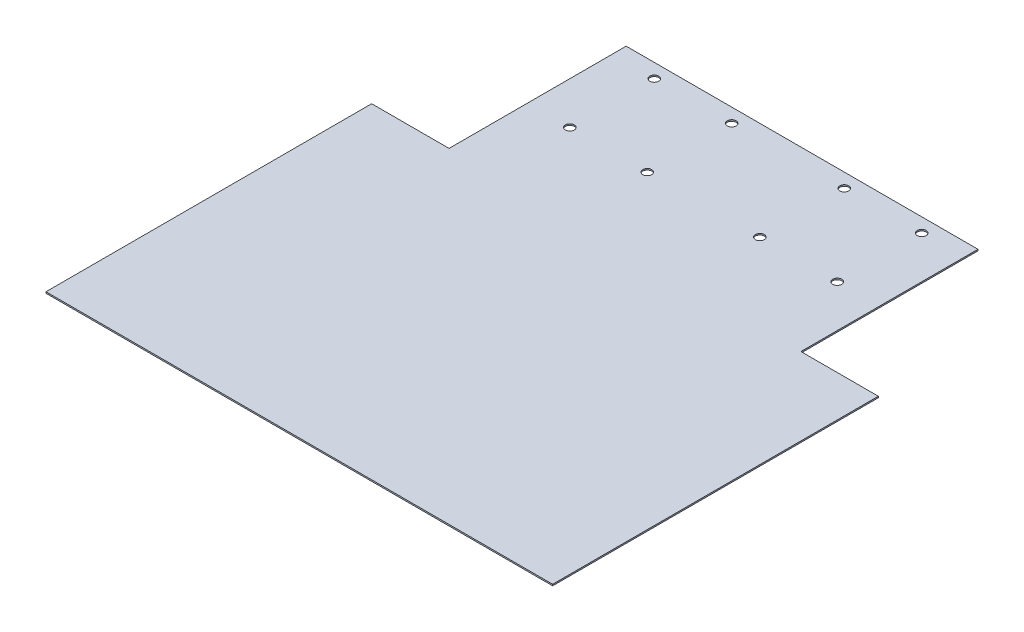
ISO-10303-21;
HEADER;
FILE_DESCRIPTION(('STEP AP214'),'2;1');
FILE_NAME('part.step','',(''),(''),'','','');
FILE_SCHEMA(('AUTOMOTIVE_DESIGN { 1 0 10303 214 1 1 1 1 }'));
ENDSEC;
DATA;
#1=APPLICATION_CONTEXT('core data for automotive mechanical design processes');
#2=APPLICATION_PROTOCOL_DEFINITION('international standard','automotive_design',2000,#1);
#3=PRODUCT_CONTEXT('',#1,'mechanical');
#4=PRODUCT('Part','Part','',(#3));
#5=PRODUCT_RELATED_PRODUCT_CATEGORY('part','',(#4));
#6=PRODUCT_DEFINITION_FORMATION('','',#4);
#7=PRODUCT_DEFINITION_CONTEXT('part definition',#1,'design');
#8=PRODUCT_DEFINITION('design','',#6,#7);
#9=PRODUCT_DEFINITION_SHAPE('','',#8);
#10=(LENGTH_UNIT() NAMED_UNIT(*) SI_UNIT(.MILLI.,.METRE.));
#11=(NAMED_UNIT(*) PLANE_ANGLE_UNIT() SI_UNIT($,.RADIAN.));
#12=(NAMED_UNIT(*) SI_UNIT($,.STERADIAN.) SOLID_ANGLE_UNIT());
#13=UNCERTAINTY_MEASURE_WITH_UNIT(LENGTH_MEASURE(1.E-05),#10,'distance_accuracy_value','');
#14=(GEOMETRIC_REPRESENTATION_CONTEXT(3) GLOBAL_UNCERTAINTY_ASSIGNED_CONTEXT((#13)) GLOBAL_UNIT_ASSIGNED_CONTEXT((#10,
#11,#12)) REPRESENTATION_CONTEXT('',''));
#15=CARTESIAN_POINT('',(0.,0.,0.));
#16=DIRECTION('',(0.,0.,1.));
#17=DIRECTION('',(1.,0.,0.));
#18=AXIS2_PLACEMENT_3D('',#15,#16,#17);
#19=CARTESIAN_POINT('',(90.,0.5,89.31));
#20=DIRECTION('',(-1.,0.,0.));
#21=DIRECTION('',(0.,0.,1.));
#22=AXIS2_PLACEMENT_3D('',#19,#20,#21);
#23=PLANE('',#22);
#24=DIRECTION('',(0.,0.,-1.));
#25=VECTOR('',#24,1.);
#26=CARTESIAN_POINT('',(90.,0.5,89.31));
#27=LINE('',#26,#25);
#28=CARTESIAN_POINT('',(90.,0.5,89.31));
#29=VERTEX_POINT('',#28);
#30=CARTESIAN_POINT('',(90.,0.5,-26.39));
#31=VERTEX_POINT('',#30);
#32=EDGE_CURVE('E107',#29,#31,#27,.T.);
#33=ORIENTED_EDGE('',*,*,#32,.F.);
#34=DIRECTION('',(0.,-1.,0.));
#35=VECTOR('',#34,1.);
#36=CARTESIAN_POINT('',(90.,0.5,89.31));
#37=LINE('',#36,#35);
#38=CARTESIAN_POINT('',(90.,0.,89.31));
#39=VERTEX_POINT('',#38);
#40=EDGE_CURVE('E204',#29,#39,#37,.T.);
#41=ORIENTED_EDGE('',*,*,#40,.T.);
#42=DIRECTION('',(0.,0.,-1.));
#43=VECTOR('',#42,1.);
#44=CARTESIAN_POINT('',(90.,0.,89.31));
#45=LINE('',#44,#43);
#46=CARTESIAN_POINT('',(90.,0.,-26.39));
#47=VERTEX_POINT('',#46);
#48=EDGE_CURVE('E153',#39,#47,#45,.T.);
#49=ORIENTED_EDGE('',*,*,#48,.T.);
#50=DIRECTION('',(0.,-1.,0.));
#51=VECTOR('',#50,1.);
#52=CARTESIAN_POINT('',(90.,0.5,-26.39));
#53=LINE('',#52,#51);
#54=EDGE_CURVE('E11',#31,#47,#53,.T.);
#55=ORIENTED_EDGE('',*,*,#54,.F.);
#56=EDGE_LOOP('',(#33,#41,#49,#55));
#57=FACE_BOUND('',#56,.T.);
#58=ADVANCED_FACE('F49',(#57),#23,.F.);
#59=CARTESIAN_POINT('',(90.,0.5,-26.39));
#60=DIRECTION('',(0.,0.,1.));
#61=DIRECTION('',(1.,0.,0.));
#62=AXIS2_PLACEMENT_3D('',#59,#60,#61);
#63=PLANE('',#62);
#64=DIRECTION('',(-1.,0.,0.));
#65=VECTOR('',#64,1.);
#66=CARTESIAN_POINT('',(90.,0.,-26.39));
#67=LINE('',#66,#65);
#68=CARTESIAN_POINT('',(62.5,0.,-26.39));
#69=VERTEX_POINT('',#68);
#70=EDGE_CURVE('E157',#47,#69,#67,.T.);
#71=ORIENTED_EDGE('',*,*,#70,.T.);
#72=DIRECTION('',(0.,-1.,0.));
#73=VECTOR('',#72,1.);
#74=CARTESIAN_POINT('',(62.5,0.5,-26.39));
#75=LINE('',#74,#73);
#76=CARTESIAN_POINT('',(62.5,0.5,-26.39));
#77=VERTEX_POINT('',#76);
#78=EDGE_CURVE('E58',#77,#69,#75,.T.);
#79=ORIENTED_EDGE('',*,*,#78,.F.);
#80=DIRECTION('',(-1.,0.,0.));
#81=VECTOR('',#80,1.);
#82=CARTESIAN_POINT('',(90.,0.5,-26.39));
#83=LINE('',#82,#81);
#84=EDGE_CURVE('E215',#31,#77,#83,.T.);
#85=ORIENTED_EDGE('',*,*,#84,.F.);
#86=ORIENTED_EDGE('',*,*,#54,.T.);
#87=EDGE_LOOP('',(#71,#79,#85,#86));
#88=FACE_BOUND('',#87,.T.);
#89=ADVANCED_FACE('F218',(#88),#63,.F.);
#90=CARTESIAN_POINT('',(62.5,0.5,-26.39));
#91=DIRECTION('',(-1.,0.,0.));
#92=DIRECTION('',(0.,0.,1.));
#93=AXIS2_PLACEMENT_3D('',#90,#91,#92);
#94=PLANE('',#93);
#95=DIRECTION('',(0.,0.,-1.));
#96=VECTOR('',#95,1.);
#97=CARTESIAN_POINT('',(62.5,0.,-26.39));
#98=LINE('',#97,#96);
#99=CARTESIAN_POINT('',(62.5,0.,-89.31));
#100=VERTEX_POINT('',#99);
#101=EDGE_CURVE('E161',#69,#100,#98,.T.);
#102=ORIENTED_EDGE('',*,*,#101,.T.);
#103=DIRECTION('',(0.,-1.,0.));
#104=VECTOR('',#103,1.);
#105=CARTESIAN_POINT('',(62.5,0.5,-89.31));
#106=LINE('',#105,#104);
#107=CARTESIAN_POINT('',(62.5,0.5,-89.31));
#108=VERTEX_POINT('',#107);
#109=EDGE_CURVE('E139',#108,#100,#106,.T.);
#110=ORIENTED_EDGE('',*,*,#109,.F.);
#111=DIRECTION('',(0.,0.,-1.));
#112=VECTOR('',#111,1.);
#113=CARTESIAN_POINT('',(62.5,0.5,-26.39));
#114=LINE('',#113,#112);
#115=EDGE_CURVE('E125',#77,#108,#114,.T.);
#116=ORIENTED_EDGE('',*,*,#115,.F.);
#117=ORIENTED_EDGE('',*,*,#78,.T.);
#118=EDGE_LOOP('',(#102,#110,#116,#117));
#119=FACE_BOUND('',#118,.T.);
#120=ADVANCED_FACE('F187',(#119),#94,.F.);
#121=CARTESIAN_POINT('',(62.5,0.5,-89.31));
#122=DIRECTION('',(0.,0.,1.));
#123=DIRECTION('',(1.,0.,0.));
#124=AXIS2_PLACEMENT_3D('',#121,#122,#123);
#125=PLANE('',#124);
#126=DIRECTION('',(-1.,0.,0.));
#127=VECTOR('',#126,1.);
#128=CARTESIAN_POINT('',(62.5,0.,-89.31));
#129=LINE('',#128,#127);
#130=CARTESIAN_POINT('',(-62.5,0.,-89.31));
#131=VERTEX_POINT('',#130);
#132=EDGE_CURVE('E135',#100,#131,#129,.T.);
#133=ORIENTED_EDGE('',*,*,#132,.T.);
#134=DIRECTION('',(0.,-1.,0.));
#135=VECTOR('',#134,1.);
#136=CARTESIAN_POINT('',(-62.5,0.5,-89.31));
#137=LINE('',#136,#135);
#138=CARTESIAN_POINT('',(-62.5,0.5,-89.31));
#139=VERTEX_POINT('',#138);
#140=EDGE_CURVE('E132',#139,#131,#137,.T.);
#141=ORIENTED_EDGE('',*,*,#140,.F.);
#142=DIRECTION('',(-1.,0.,0.));
#143=VECTOR('',#142,1.);
#144=CARTESIAN_POINT('',(62.5,0.5,-89.31));
#145=LINE('',#144,#143);
#146=EDGE_CURVE('E118',#108,#139,#145,.T.);
#147=ORIENTED_EDGE('',*,*,#146,.F.);
#148=ORIENTED_EDGE('',*,*,#109,.T.);
#149=EDGE_LOOP('',(#133,#141,#147,#148));
#150=FACE_BOUND('',#149,.T.);
#151=ADVANCED_FACE('F133',(#150),#125,.F.);
#152=CARTESIAN_POINT('',(-62.5,0.5,-26.39));
#153=DIRECTION('',(1.,0.,0.));
#154=DIRECTION('',(0.,0.,-1.));
#155=AXIS2_PLACEMENT_3D('',#152,#153,#154);
#156=PLANE('',#155);
#157=DIRECTION('',(0.,0.,1.));
#158=VECTOR('',#157,1.);
#159=CARTESIAN_POINT('',(-62.5,0.,-26.39));
#160=LINE('',#159,#158);
#161=CARTESIAN_POINT('',(-62.5,0.,-26.39));
#162=VERTEX_POINT('',#161);
#163=EDGE_CURVE('E166',#131,#162,#160,.T.);
#164=ORIENTED_EDGE('',*,*,#163,.T.);
#165=DIRECTION('',(0.,-1.,0.));
#166=VECTOR('',#165,1.);
#167=CARTESIAN_POINT('',(-62.5,0.5,-26.39));
#168=LINE('',#167,#166);
#169=CARTESIAN_POINT('',(-62.5,0.5,-26.39));
#170=VERTEX_POINT('',#169);
#171=EDGE_CURVE('E140',#170,#162,#168,.T.);
#172=ORIENTED_EDGE('',*,*,#171,.F.);
#173=DIRECTION('',(0.,0.,1.));
#174=VECTOR('',#173,1.);
#175=CARTESIAN_POINT('',(-62.5,0.5,-26.39));
#176=LINE('',#175,#174);
#177=EDGE_CURVE('E122',#139,#170,#176,.T.);
#178=ORIENTED_EDGE('',*,*,#177,.F.);
#179=ORIENTED_EDGE('',*,*,#140,.T.);
#180=EDGE_LOOP('',(#164,#172,#178,#179));
#181=FACE_BOUND('',#180,.T.);
#182=ADVANCED_FACE('F142',(#181),#156,.F.);
#183=CARTESIAN_POINT('',(-90.,0.5,-26.39));
#184=DIRECTION('',(0.,0.,1.));
#185=DIRECTION('',(1.,0.,0.));
#186=AXIS2_PLACEMENT_3D('',#183,#184,#185);
#187=PLANE('',#186);
#188=DIRECTION('',(-1.,0.,0.));
#189=VECTOR('',#188,1.);
#190=CARTESIAN_POINT('',(-90.,0.,-26.39));
#191=LINE('',#190,#189);
#192=CARTESIAN_POINT('',(-90.,0.,-26.39));
#193=VERTEX_POINT('',#192);
#194=EDGE_CURVE('E92',#162,#193,#191,.T.);
#195=ORIENTED_EDGE('',*,*,#194,.T.);
#196=DIRECTION('',(0.,-1.,0.));
#197=VECTOR('',#196,1.);
#198=CARTESIAN_POINT('',(-90.,0.5,-26.39));
#199=LINE('',#198,#197);
#200=CARTESIAN_POINT('',(-90.,0.5,-26.39));
#201=VERTEX_POINT('',#200);
#202=EDGE_CURVE('E152',#201,#193,#199,.T.);
#203=ORIENTED_EDGE('',*,*,#202,.F.);
#204=DIRECTION('',(-1.,0.,0.));
#205=VECTOR('',#204,1.);
#206=CARTESIAN_POINT('',(-90.,0.5,-26.39));
#207=LINE('',#206,#205);
#208=EDGE_CURVE('E66',#170,#201,#207,.T.);
#209=ORIENTED_EDGE('',*,*,#208,.F.);
#210=ORIENTED_EDGE('',*,*,#171,.T.);
#211=EDGE_LOOP('',(#195,#203,#209,#210));
#212=FACE_BOUND('',#211,.T.);
#213=ADVANCED_FACE('F192',(#212),#187,.F.);
#214=CARTESIAN_POINT('',(-90.,0.5,89.31));
#215=DIRECTION('',(1.,0.,0.));
#216=DIRECTION('',(0.,0.,-1.));
#217=AXIS2_PLACEMENT_3D('',#214,#215,#216);
#218=PLANE('',#217);
#219=DIRECTION('',(0.,0.,1.));
#220=VECTOR('',#219,1.);
#221=CARTESIAN_POINT('',(-90.,0.,89.31));
#222=LINE('',#221,#220);
#223=CARTESIAN_POINT('',(-90.,0.,89.31));
#224=VERTEX_POINT('',#223);
#225=EDGE_CURVE('E99',#193,#224,#222,.T.);
#226=ORIENTED_EDGE('',*,*,#225,.T.);
#227=DIRECTION('',(0.,-1.,0.));
#228=VECTOR('',#227,1.);
#229=CARTESIAN_POINT('',(-90.,0.5,89.31));
#230=LINE('',#229,#228);
#231=CARTESIAN_POINT('',(-90.,0.5,89.31));
#232=VERTEX_POINT('',#231);
#233=EDGE_CURVE('E158',#232,#224,#230,.T.);
#234=ORIENTED_EDGE('',*,*,#233,.F.);
#235=DIRECTION('',(0.,0.,1.));
#236=VECTOR('',#235,1.);
#237=CARTESIAN_POINT('',(-90.,0.5,89.31));
#238=LINE('',#237,#236);
#239=EDGE_CURVE('E146',#201,#232,#238,.T.);
#240=ORIENTED_EDGE('',*,*,#239,.F.);
#241=ORIENTED_EDGE('',*,*,#202,.T.);
#242=EDGE_LOOP('',(#226,#234,#240,#241));
#243=FACE_BOUND('',#242,.T.);
#244=ADVANCED_FACE('F194',(#243),#218,.F.);
#245=CARTESIAN_POINT('',(0.,0.5,0.));
#246=DIRECTION('',(0.,1.,0.));
#247=DIRECTION('',(0.,0.,1.));
#248=AXIS2_PLACEMENT_3D('',#245,#246,#247);
#249=PLANE('',#248);
#250=CARTESIAN_POINT('',(20.,0.5,-84.3100000000001));
#251=DIRECTION('',(0.,-1.,0.));
#252=DIRECTION('',(0.,0.,1.));
#253=AXIS2_PLACEMENT_3D('',#250,#251,#252);
#254=CIRCLE('',#253,1.585);
#255=CARTESIAN_POINT('',(20.,0.5,-82.7250000000002));
#256=VERTEX_POINT('',#255);
#257=EDGE_CURVE('E297',#256,#256,#254,.T.);
#258=ORIENTED_EDGE('',*,*,#257,.T.);
#259=EDGE_LOOP('',(#258));
#260=FACE_BOUND('',#259,.T.);
#261=CARTESIAN_POINT('',(47.5,0.5,-84.3099999999997));
#262=DIRECTION('',(0.,-1.,0.));
#263=DIRECTION('',(0.,0.,1.));
#264=AXIS2_PLACEMENT_3D('',#261,#262,#263);
#265=CIRCLE('',#264,1.58499999999999);
#266=CARTESIAN_POINT('',(47.5,0.5,-82.7249999999997));
#267=VERTEX_POINT('',#266);
#268=EDGE_CURVE('E284',#267,#267,#265,.T.);
#269=ORIENTED_EDGE('',*,*,#268,.T.);
#270=EDGE_LOOP('',(#269));
#271=FACE_BOUND('',#270,.T.);
#272=CARTESIAN_POINT('',(47.5,0.5,-54.3100000000003));
#273=DIRECTION('',(0.,-1.,0.));
#274=DIRECTION('',(0.,0.,1.));
#275=AXIS2_PLACEMENT_3D('',#272,#273,#274);
#276=CIRCLE('',#275,1.58499999999999);
#277=CARTESIAN_POINT('',(47.5,0.5,-52.7250000000003));
#278=VERTEX_POINT('',#277);
#279=EDGE_CURVE('E278',#278,#278,#276,.T.);
#280=ORIENTED_EDGE('',*,*,#279,.T.);
#281=EDGE_LOOP('',(#280));
#282=FACE_BOUND('',#281,.T.);
#283=CARTESIAN_POINT('',(20.,0.5,-54.3099999999999));
#284=DIRECTION('',(0.,-1.,0.));
#285=DIRECTION('',(0.,0.,1.));
#286=AXIS2_PLACEMENT_3D('',#283,#284,#285);
#287=CIRCLE('',#286,1.585);
#288=CARTESIAN_POINT('',(20.,0.5,-52.7249999999999));
#289=VERTEX_POINT('',#288);
#290=EDGE_CURVE('E305',#289,#289,#287,.T.);
#291=ORIENTED_EDGE('',*,*,#290,.T.);
#292=EDGE_LOOP('',(#291));
#293=FACE_BOUND('',#292,.T.);
#294=CARTESIAN_POINT('',(-20.,0.5,-84.3100000000001));
#295=DIRECTION('',(0.,1.,0.));
#296=DIRECTION('',(0.,0.,1.));
#297=AXIS2_PLACEMENT_3D('',#294,#295,#296);
#298=CIRCLE('',#297,1.585);
#299=CARTESIAN_POINT('',(-20.,0.5,-82.7250000000002));
#300=VERTEX_POINT('',#299);
#301=EDGE_CURVE('E327',#300,#300,#298,.T.);
#302=ORIENTED_EDGE('',*,*,#301,.F.);
#303=EDGE_LOOP('',(#302));
#304=FACE_BOUND('',#303,.T.);
#305=CARTESIAN_POINT('',(-47.5,0.5,-84.3099999999997));
#306=DIRECTION('',(0.,1.,0.));
#307=DIRECTION('',(0.,0.,1.));
#308=AXIS2_PLACEMENT_3D('',#305,#306,#307);
#309=CIRCLE('',#308,1.58499999999999);
#310=CARTESIAN_POINT('',(-47.5,0.5,-82.7249999999997));
#311=VERTEX_POINT('',#310);
#312=EDGE_CURVE('E318',#311,#311,#309,.T.);
#313=ORIENTED_EDGE('',*,*,#312,.F.);
#314=EDGE_LOOP('',(#313));
#315=FACE_BOUND('',#314,.T.);
#316=CARTESIAN_POINT('',(-47.5,0.5,-54.3100000000003));
#317=DIRECTION('',(0.,1.,0.));
#318=DIRECTION('',(0.,0.,1.));
#319=AXIS2_PLACEMENT_3D('',#316,#317,#318);
#320=CIRCLE('',#319,1.58499999999999);
#321=CARTESIAN_POINT('',(-47.5,0.5,-52.7250000000003));
#322=VERTEX_POINT('',#321);
#323=EDGE_CURVE('E317',#322,#322,#320,.T.);
#324=ORIENTED_EDGE('',*,*,#323,.F.);
#325=EDGE_LOOP('',(#324));
#326=FACE_BOUND('',#325,.T.);
#327=CARTESIAN_POINT('',(-20.,0.5,-54.3099999999999));
#328=DIRECTION('',(0.,1.,0.));
#329=DIRECTION('',(0.,0.,1.));
#330=AXIS2_PLACEMENT_3D('',#327,#328,#329);
#331=CIRCLE('',#330,1.585);
#332=CARTESIAN_POINT('',(-20.,0.5,-52.7249999999999));
#333=VERTEX_POINT('',#332);
#334=EDGE_CURVE('E322',#333,#333,#331,.T.);
#335=ORIENTED_EDGE('',*,*,#334,.F.);
#336=EDGE_LOOP('',(#335));
#337=FACE_BOUND('',#336,.T.);
#338=ORIENTED_EDGE('',*,*,#239,.T.);
#339=DIRECTION('',(-1.,0.,0.));
#340=VECTOR('',#339,1.);
#341=CARTESIAN_POINT('',(-90.,0.5,89.31));
#342=LINE('',#341,#340);
#343=EDGE_CURVE('E198',#29,#232,#342,.T.);
#344=ORIENTED_EDGE('',*,*,#343,.F.);
#345=ORIENTED_EDGE('',*,*,#32,.T.);
#346=ORIENTED_EDGE('',*,*,#84,.T.);
#347=ORIENTED_EDGE('',*,*,#115,.T.);
#348=ORIENTED_EDGE('',*,*,#146,.T.);
#349=ORIENTED_EDGE('',*,*,#177,.T.);
#350=ORIENTED_EDGE('',*,*,#208,.T.);
#351=EDGE_LOOP('',(#338,#344,#345,#346,#347,#348,#349,#350));
#352=FACE_BOUND('',#351,.T.);
#353=ADVANCED_FACE('F120',(#260,#271,#282,#293,#304,#315,#326,#337,#352),#249,.T.);
#354=CARTESIAN_POINT('',(0.,0.,0.));
#355=DIRECTION('',(0.,1.,0.));
#356=DIRECTION('',(0.,0.,1.));
#357=AXIS2_PLACEMENT_3D('',#354,#355,#356);
#358=PLANE('',#357);
#359=CARTESIAN_POINT('',(20.,0.,-84.3100000000001));
#360=DIRECTION('',(0.,1.,0.));
#361=DIRECTION('',(0.,0.,1.));
#362=AXIS2_PLACEMENT_3D('',#359,#360,#361);
#363=CIRCLE('',#362,1.585);
#364=CARTESIAN_POINT('',(20.,0.,-82.7250000000002));
#365=VERTEX_POINT('',#364);
#366=EDGE_CURVE('E301',#365,#365,#363,.T.);
#367=ORIENTED_EDGE('',*,*,#366,.T.);
#368=EDGE_LOOP('',(#367));
#369=FACE_BOUND('',#368,.T.);
#370=CARTESIAN_POINT('',(47.5,0.,-84.3099999999997));
#371=DIRECTION('',(0.,1.,0.));
#372=DIRECTION('',(0.,0.,1.));
#373=AXIS2_PLACEMENT_3D('',#370,#371,#372);
#374=CIRCLE('',#373,1.58499999999999);
#375=CARTESIAN_POINT('',(47.5,0.,-82.7249999999997));
#376=VERTEX_POINT('',#375);
#377=EDGE_CURVE('E291',#376,#376,#374,.T.);
#378=ORIENTED_EDGE('',*,*,#377,.T.);
#379=EDGE_LOOP('',(#378));
#380=FACE_BOUND('',#379,.T.);
#381=CARTESIAN_POINT('',(47.5,0.,-54.3100000000003));
#382=DIRECTION('',(0.,1.,0.));
#383=DIRECTION('',(0.,0.,1.));
#384=AXIS2_PLACEMENT_3D('',#381,#382,#383);
#385=CIRCLE('',#384,1.58499999999999);
#386=CARTESIAN_POINT('',(47.5,0.,-52.7250000000003));
#387=VERTEX_POINT('',#386);
#388=EDGE_CURVE('E281',#387,#387,#385,.T.);
#389=ORIENTED_EDGE('',*,*,#388,.T.);
#390=EDGE_LOOP('',(#389));
#391=FACE_BOUND('',#390,.T.);
#392=CARTESIAN_POINT('',(20.,0.,-54.3099999999999));
#393=DIRECTION('',(0.,1.,0.));
#394=DIRECTION('',(0.,0.,1.));
#395=AXIS2_PLACEMENT_3D('',#392,#393,#394);
#396=CIRCLE('',#395,1.585);
#397=CARTESIAN_POINT('',(20.,0.,-52.7249999999999));
#398=VERTEX_POINT('',#397);
#399=EDGE_CURVE('E288',#398,#398,#396,.T.);
#400=ORIENTED_EDGE('',*,*,#399,.T.);
#401=EDGE_LOOP('',(#400));
#402=FACE_BOUND('',#401,.T.);
#403=CARTESIAN_POINT('',(-20.,0.,-84.3100000000001));
#404=DIRECTION('',(0.,1.,0.));
#405=DIRECTION('',(0.,0.,1.));
#406=AXIS2_PLACEMENT_3D('',#403,#404,#405);
#407=CIRCLE('',#406,1.585);
#408=CARTESIAN_POINT('',(-20.,0.,-82.7250000000002));
#409=VERTEX_POINT('',#408);
#410=EDGE_CURVE('E309',#409,#409,#407,.F.);
#411=ORIENTED_EDGE('',*,*,#410,.F.);
#412=EDGE_LOOP('',(#411));
#413=FACE_BOUND('',#412,.T.);
#414=CARTESIAN_POINT('',(-47.5,0.,-84.3099999999997));
#415=DIRECTION('',(0.,1.,0.));
#416=DIRECTION('',(0.,0.,1.));
#417=AXIS2_PLACEMENT_3D('',#414,#415,#416);
#418=CIRCLE('',#417,1.58499999999999);
#419=CARTESIAN_POINT('',(-47.5,0.,-82.7249999999997));
#420=VERTEX_POINT('',#419);
#421=EDGE_CURVE('E323',#420,#420,#418,.F.);
#422=ORIENTED_EDGE('',*,*,#421,.F.);
#423=EDGE_LOOP('',(#422));
#424=FACE_BOUND('',#423,.T.);
#425=CARTESIAN_POINT('',(-47.5,0.,-54.3100000000003));
#426=DIRECTION('',(0.,1.,0.));
#427=DIRECTION('',(0.,0.,1.));
#428=AXIS2_PLACEMENT_3D('',#425,#426,#427);
#429=CIRCLE('',#428,1.58499999999999);
#430=CARTESIAN_POINT('',(-47.5,0.,-52.7250000000003));
#431=VERTEX_POINT('',#430);
#432=EDGE_CURVE('E313',#431,#431,#429,.F.);
#433=ORIENTED_EDGE('',*,*,#432,.F.);
#434=EDGE_LOOP('',(#433));
#435=FACE_BOUND('',#434,.T.);
#436=CARTESIAN_POINT('',(-20.,0.,-54.3099999999999));
#437=DIRECTION('',(0.,1.,0.));
#438=DIRECTION('',(0.,0.,1.));
#439=AXIS2_PLACEMENT_3D('',#436,#437,#438);
#440=CIRCLE('',#439,1.585);
#441=CARTESIAN_POINT('',(-20.,0.,-52.7249999999999));
#442=VERTEX_POINT('',#441);
#443=EDGE_CURVE('E340',#442,#442,#440,.F.);
#444=ORIENTED_EDGE('',*,*,#443,.F.);
#445=EDGE_LOOP('',(#444));
#446=FACE_BOUND('',#445,.T.);
#447=ORIENTED_EDGE('',*,*,#48,.F.);
#448=DIRECTION('',(1.,0.,0.));
#449=VECTOR('',#448,1.);
#450=CARTESIAN_POINT('',(90.,0.,89.31));
#451=LINE('',#450,#449);
#452=EDGE_CURVE('E173',#224,#39,#451,.T.);
#453=ORIENTED_EDGE('',*,*,#452,.F.);
#454=ORIENTED_EDGE('',*,*,#225,.F.);
#455=ORIENTED_EDGE('',*,*,#194,.F.);
#456=ORIENTED_EDGE('',*,*,#163,.F.);
#457=ORIENTED_EDGE('',*,*,#132,.F.);
#458=ORIENTED_EDGE('',*,*,#101,.F.);
#459=ORIENTED_EDGE('',*,*,#70,.F.);
#460=EDGE_LOOP('',(#447,#453,#454,#455,#456,#457,#458,#459));
#461=FACE_BOUND('',#460,.T.);
#462=ADVANCED_FACE('F191',(#369,#380,#391,#402,#413,#424,#435,#446,#461),#358,.F.);
#463=CARTESIAN_POINT('',(-90.,0.5,89.31));
#464=DIRECTION('',(0.,0.,1.));
#465=DIRECTION('',(1.,0.,0.));
#466=AXIS2_PLACEMENT_3D('',#463,#464,#465);
#467=PLANE('',#466);
#468=ORIENTED_EDGE('',*,*,#452,.T.);
#469=ORIENTED_EDGE('',*,*,#40,.F.);
#470=ORIENTED_EDGE('',*,*,#343,.T.);
#471=ORIENTED_EDGE('',*,*,#233,.T.);
#472=EDGE_LOOP('',(#468,#469,#470,#471));
#473=FACE_BOUND('',#472,.T.);
#474=ADVANCED_FACE('F208',(#473),#467,.T.);
#475=CARTESIAN_POINT('',(-20.,-0.00100000000000002,-54.3099999999999));
#476=DIRECTION('',(0.,1.,0.));
#477=DIRECTION('',(0.,0.,1.));
#478=AXIS2_PLACEMENT_3D('',#475,#476,#477);
#479=CYLINDRICAL_SURFACE('',#478,1.585);
#480=ORIENTED_EDGE('',*,*,#334,.T.);
#481=EDGE_LOOP('',(#480));
#482=FACE_BOUND('',#481,.T.);
#483=ORIENTED_EDGE('',*,*,#443,.T.);
#484=EDGE_LOOP('',(#483));
#485=FACE_BOUND('',#484,.T.);
#486=ADVANCED_FACE('F242',(#482,#485),#479,.F.);
#487=CARTESIAN_POINT('',(-47.5,-0.00100000000000002,-54.3100000000003));
#488=DIRECTION('',(0.,1.,0.));
#489=DIRECTION('',(0.,0.,1.));
#490=AXIS2_PLACEMENT_3D('',#487,#488,#489);
#491=CYLINDRICAL_SURFACE('',#490,1.58499999999999);
#492=ORIENTED_EDGE('',*,*,#323,.T.);
#493=EDGE_LOOP('',(#492));
#494=FACE_BOUND('',#493,.T.);
#495=ORIENTED_EDGE('',*,*,#432,.T.);
#496=EDGE_LOOP('',(#495));
#497=FACE_BOUND('',#496,.T.);
#498=ADVANCED_FACE('F245',(#494,#497),#491,.F.);
#499=CARTESIAN_POINT('',(-47.5,-0.00100000000000002,-84.3099999999997));
#500=DIRECTION('',(0.,1.,0.));
#501=DIRECTION('',(0.,0.,1.));
#502=AXIS2_PLACEMENT_3D('',#499,#500,#501);
#503=CYLINDRICAL_SURFACE('',#502,1.58499999999999);
#504=ORIENTED_EDGE('',*,*,#312,.T.);
#505=EDGE_LOOP('',(#504));
#506=FACE_BOUND('',#505,.T.);
#507=ORIENTED_EDGE('',*,*,#421,.T.);
#508=EDGE_LOOP('',(#507));
#509=FACE_BOUND('',#508,.T.);
#510=ADVANCED_FACE('F251',(#506,#509),#503,.F.);
#511=CARTESIAN_POINT('',(-20.,-0.00100000000000002,-84.3100000000001));
#512=DIRECTION('',(0.,1.,0.));
#513=DIRECTION('',(0.,0.,1.));
#514=AXIS2_PLACEMENT_3D('',#511,#512,#513);
#515=CYLINDRICAL_SURFACE('',#514,1.585);
#516=ORIENTED_EDGE('',*,*,#301,.T.);
#517=EDGE_LOOP('',(#516));
#518=FACE_BOUND('',#517,.T.);
#519=ORIENTED_EDGE('',*,*,#410,.T.);
#520=EDGE_LOOP('',(#519));
#521=FACE_BOUND('',#520,.T.);
#522=ADVANCED_FACE('F247',(#518,#521),#515,.F.);
#523=CARTESIAN_POINT('',(20.,-0.00100000000000002,-54.3099999999999));
#524=DIRECTION('',(0.,1.,0.));
#525=DIRECTION('',(0.,0.,1.));
#526=AXIS2_PLACEMENT_3D('',#523,#524,#525);
#527=CYLINDRICAL_SURFACE('',#526,1.585);
#528=ORIENTED_EDGE('',*,*,#290,.F.);
#529=EDGE_LOOP('',(#528));
#530=FACE_BOUND('',#529,.T.);
#531=ORIENTED_EDGE('',*,*,#399,.F.);
#532=EDGE_LOOP('',(#531));
#533=FACE_BOUND('',#532,.T.);
#534=ADVANCED_FACE('F250',(#530,#533),#527,.F.);
#535=CARTESIAN_POINT('',(47.5,-0.00100000000000002,-54.3100000000003));
#536=DIRECTION('',(0.,1.,0.));
#537=DIRECTION('',(0.,0.,1.));
#538=AXIS2_PLACEMENT_3D('',#535,#536,#537);
#539=CYLINDRICAL_SURFACE('',#538,1.58499999999999);
#540=ORIENTED_EDGE('',*,*,#279,.F.);
#541=EDGE_LOOP('',(#540));
#542=FACE_BOUND('',#541,.T.);
#543=ORIENTED_EDGE('',*,*,#388,.F.);
#544=EDGE_LOOP('',(#543));
#545=FACE_BOUND('',#544,.T.);
#546=ADVANCED_FACE('F261',(#542,#545),#539,.F.);
#547=CARTESIAN_POINT('',(47.5,-0.00100000000000002,-84.3099999999997));
#548=DIRECTION('',(0.,1.,0.));
#549=DIRECTION('',(0.,0.,1.));
#550=AXIS2_PLACEMENT_3D('',#547,#548,#549);
#551=CYLINDRICAL_SURFACE('',#550,1.58499999999999);
#552=ORIENTED_EDGE('',*,*,#268,.F.);
#553=EDGE_LOOP('',(#552));
#554=FACE_BOUND('',#553,.T.);
#555=ORIENTED_EDGE('',*,*,#377,.F.);
#556=EDGE_LOOP('',(#555));
#557=FACE_BOUND('',#556,.T.);
#558=ADVANCED_FACE('F266',(#554,#557),#551,.F.);
#559=CARTESIAN_POINT('',(20.,-0.00100000000000002,-84.3100000000001));
#560=DIRECTION('',(0.,1.,0.));
#561=DIRECTION('',(0.,0.,1.));
#562=AXIS2_PLACEMENT_3D('',#559,#560,#561);
#563=CYLINDRICAL_SURFACE('',#562,1.585);
#564=ORIENTED_EDGE('',*,*,#257,.F.);
#565=EDGE_LOOP('',(#564));
#566=FACE_BOUND('',#565,.T.);
#567=ORIENTED_EDGE('',*,*,#366,.F.);
#568=EDGE_LOOP('',(#567));
#569=FACE_BOUND('',#568,.T.);
#570=ADVANCED_FACE('F263',(#566,#569),#563,.F.);
#571=CLOSED_SHELL('',(#58,#89,#120,#151,#182,#213,#244,#353,#462,#474,#486,#498,#510,#522,#534,
#546,#558,#570));
#572=MANIFOLD_SOLID_BREP('B2',#571);
#573=ADVANCED_BREP_SHAPE_REPRESENTATION('',(#18,#572),#14);
#574=SHAPE_DEFINITION_REPRESENTATION(#9,#573);
ENDSEC;
END-ISO-10303-21;
